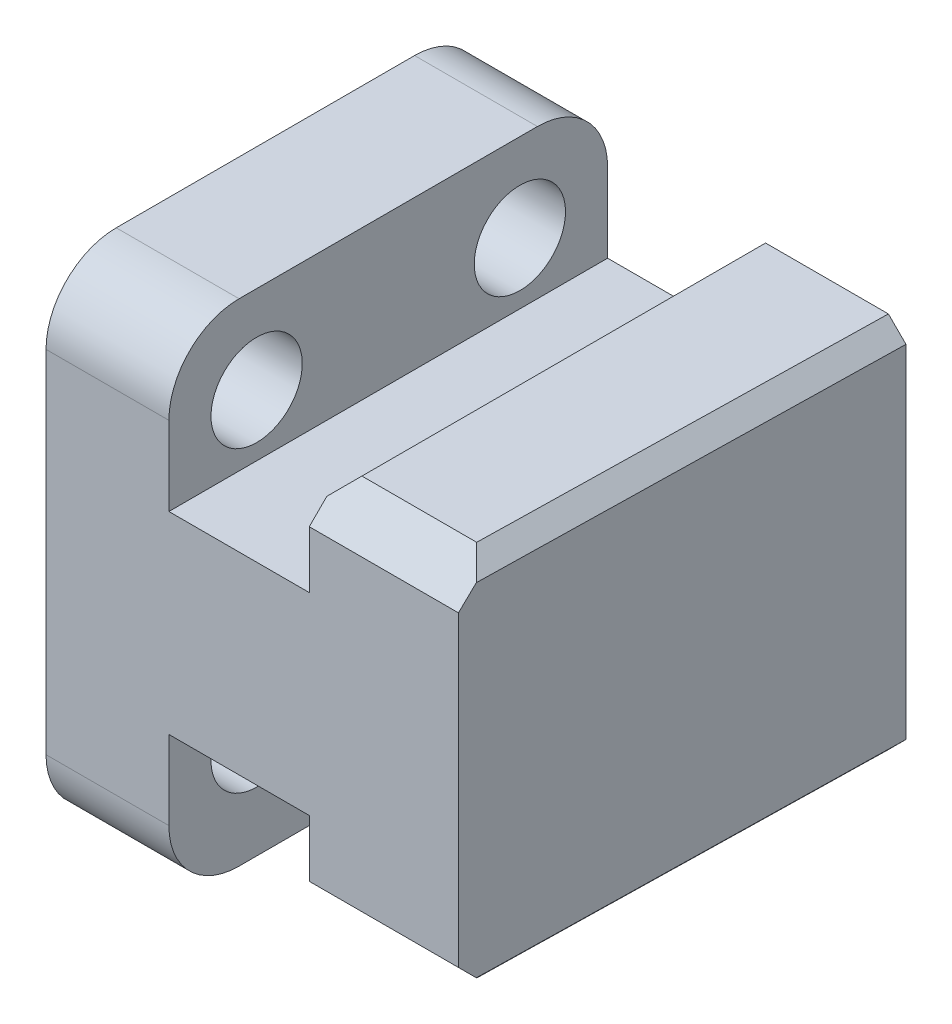
ISO-10303-21;
HEADER;
FILE_DESCRIPTION(('STEP AP214'),'2;1');
FILE_NAME('part.step','',(''),(''),'','','');
FILE_SCHEMA(('AUTOMOTIVE_DESIGN { 1 0 10303 214 1 1 1 1 }'));
ENDSEC;
DATA;
#1=APPLICATION_CONTEXT('core data for automotive mechanical design processes');
#2=APPLICATION_PROTOCOL_DEFINITION('international standard','automotive_design',2000,#1);
#3=PRODUCT_CONTEXT('',#1,'mechanical');
#4=PRODUCT('Part','Part','',(#3));
#5=PRODUCT_RELATED_PRODUCT_CATEGORY('part','',(#4));
#6=PRODUCT_DEFINITION_FORMATION('','',#4);
#7=PRODUCT_DEFINITION_CONTEXT('part definition',#1,'design');
#8=PRODUCT_DEFINITION('design','',#6,#7);
#9=PRODUCT_DEFINITION_SHAPE('','',#8);
#10=(LENGTH_UNIT() NAMED_UNIT(*) SI_UNIT(.MILLI.,.METRE.));
#11=(NAMED_UNIT(*) PLANE_ANGLE_UNIT() SI_UNIT($,.RADIAN.));
#12=(NAMED_UNIT(*) SI_UNIT($,.STERADIAN.) SOLID_ANGLE_UNIT());
#13=UNCERTAINTY_MEASURE_WITH_UNIT(LENGTH_MEASURE(1.E-05),#10,'distance_accuracy_value','');
#14=(GEOMETRIC_REPRESENTATION_CONTEXT(3) GLOBAL_UNCERTAINTY_ASSIGNED_CONTEXT((#13)) GLOBAL_UNIT_ASSIGNED_CONTEXT((#10,
#11,#12)) REPRESENTATION_CONTEXT('',''));
#15=CARTESIAN_POINT('',(0.,0.,0.));
#16=DIRECTION('',(0.,0.,1.));
#17=DIRECTION('',(1.,0.,0.));
#18=AXIS2_PLACEMENT_3D('',#15,#16,#17);
#19=CARTESIAN_POINT('',(7.,14.,25.));
#20=DIRECTION('',(0.,-1.,0.));
#21=DIRECTION('',(0.,0.,-1.));
#22=AXIS2_PLACEMENT_3D('',#19,#20,#21);
#23=PLANE('',#22);
#24=DIRECTION('',(0.,0.,-1.));
#25=VECTOR('',#24,1.);
#26=CARTESIAN_POINT('',(7.,14.,25.));
#27=LINE('',#26,#25);
#28=CARTESIAN_POINT('',(7.,14.,21.));
#29=VERTEX_POINT('',#28);
#30=CARTESIAN_POINT('',(7.,14.,4.));
#31=VERTEX_POINT('',#30);
#32=EDGE_CURVE('E352',#29,#31,#27,.T.);
#33=ORIENTED_EDGE('',*,*,#32,.T.);
#34=DIRECTION('',(-1.,0.,0.));
#35=VECTOR('',#34,1.);
#36=CARTESIAN_POINT('',(7.,14.,4.));
#37=LINE('',#36,#35);
#38=CARTESIAN_POINT('',(0.,14.,4.));
#39=VERTEX_POINT('',#38);
#40=EDGE_CURVE('E234',#31,#39,#37,.T.);
#41=ORIENTED_EDGE('',*,*,#40,.T.);
#42=DIRECTION('',(0.,0.,-1.));
#43=VECTOR('',#42,1.);
#44=CARTESIAN_POINT('',(0.,14.,25.));
#45=LINE('',#44,#43);
#46=CARTESIAN_POINT('',(0.,14.,21.));
#47=VERTEX_POINT('',#46);
#48=EDGE_CURVE('E397',#47,#39,#45,.T.);
#49=ORIENTED_EDGE('',*,*,#48,.F.);
#50=DIRECTION('',(-1.,0.,0.));
#51=VECTOR('',#50,1.);
#52=CARTESIAN_POINT('',(7.,14.,21.));
#53=LINE('',#52,#51);
#54=EDGE_CURVE('E229',#47,#29,#53,.F.);
#55=ORIENTED_EDGE('',*,*,#54,.T.);
#56=EDGE_LOOP('',(#33,#41,#49,#55));
#57=FACE_BOUND('',#56,.T.);
#58=ADVANCED_FACE('F33',(#57),#23,.F.);
#59=CARTESIAN_POINT('',(0.,14.,25.));
#60=DIRECTION('',(1.,0.,0.));
#61=DIRECTION('',(0.,1.,0.));
#62=AXIS2_PLACEMENT_3D('',#59,#60,#61);
#63=PLANE('',#62);
#64=CARTESIAN_POINT('',(0.,-8.,20.));
#65=DIRECTION('',(-1.,0.,0.));
#66=DIRECTION('',(0.,-1.,0.));
#67=AXIS2_PLACEMENT_3D('',#64,#65,#66);
#68=CIRCLE('',#67,2.6);
#69=CARTESIAN_POINT('',(0.,-10.6,20.));
#70=VERTEX_POINT('',#69);
#71=EDGE_CURVE('E221',#70,#70,#68,.T.);
#72=ORIENTED_EDGE('',*,*,#71,.F.);
#73=EDGE_LOOP('',(#72));
#74=FACE_BOUND('',#73,.T.);
#75=CARTESIAN_POINT('',(0.,-8.,5.));
#76=DIRECTION('',(-1.,0.,0.));
#77=DIRECTION('',(0.,-1.,0.));
#78=AXIS2_PLACEMENT_3D('',#75,#76,#77);
#79=CIRCLE('',#78,2.6);
#80=CARTESIAN_POINT('',(0.,-10.6,5.));
#81=VERTEX_POINT('',#80);
#82=EDGE_CURVE('E429',#81,#81,#79,.T.);
#83=ORIENTED_EDGE('',*,*,#82,.F.);
#84=EDGE_LOOP('',(#83));
#85=FACE_BOUND('',#84,.T.);
#86=CARTESIAN_POINT('',(0.,9.,20.));
#87=DIRECTION('',(-1.,0.,0.));
#88=DIRECTION('',(0.,-1.,0.));
#89=AXIS2_PLACEMENT_3D('',#86,#87,#88);
#90=CIRCLE('',#89,2.6);
#91=CARTESIAN_POINT('',(0.,6.4,20.));
#92=VERTEX_POINT('',#91);
#93=EDGE_CURVE('E407',#92,#92,#90,.T.);
#94=ORIENTED_EDGE('',*,*,#93,.F.);
#95=EDGE_LOOP('',(#94));
#96=FACE_BOUND('',#95,.T.);
#97=CARTESIAN_POINT('',(0.,9.,5.));
#98=DIRECTION('',(-1.,0.,0.));
#99=DIRECTION('',(0.,-1.,0.));
#100=AXIS2_PLACEMENT_3D('',#97,#98,#99);
#101=CIRCLE('',#100,2.6);
#102=CARTESIAN_POINT('',(0.,6.4,5.));
#103=VERTEX_POINT('',#102);
#104=EDGE_CURVE('E403',#103,#103,#101,.T.);
#105=ORIENTED_EDGE('',*,*,#104,.F.);
#106=EDGE_LOOP('',(#105));
#107=FACE_BOUND('',#106,.T.);
#108=ORIENTED_EDGE('',*,*,#48,.T.);
#109=CARTESIAN_POINT('',(0.,10.,4.));
#110=DIRECTION('',(1.,0.,0.));
#111=DIRECTION('',(0.,1.,0.));
#112=AXIS2_PLACEMENT_3D('',#109,#110,#111);
#113=CIRCLE('',#112,4.);
#114=CARTESIAN_POINT('',(0.,10.,0.));
#115=VERTEX_POINT('',#114);
#116=EDGE_CURVE('E243',#39,#115,#113,.F.);
#117=ORIENTED_EDGE('',*,*,#116,.T.);
#118=DIRECTION('',(0.,-1.,0.));
#119=VECTOR('',#118,1.);
#120=CARTESIAN_POINT('',(0.,14.,0.));
#121=LINE('',#120,#119);
#122=CARTESIAN_POINT('',(0.,-10.,0.));
#123=VERTEX_POINT('',#122);
#124=EDGE_CURVE('E353',#115,#123,#121,.T.);
#125=ORIENTED_EDGE('',*,*,#124,.T.);
#126=CARTESIAN_POINT('',(0.,-10.,4.));
#127=DIRECTION('',(1.,0.,0.));
#128=DIRECTION('',(0.,1.,0.));
#129=AXIS2_PLACEMENT_3D('',#126,#127,#128);
#130=CIRCLE('',#129,4.);
#131=CARTESIAN_POINT('',(0.,-14.,4.));
#132=VERTEX_POINT('',#131);
#133=EDGE_CURVE('E241',#123,#132,#130,.F.);
#134=ORIENTED_EDGE('',*,*,#133,.T.);
#135=DIRECTION('',(0.,0.,-1.));
#136=VECTOR('',#135,1.);
#137=CARTESIAN_POINT('',(0.,-14.,25.));
#138=LINE('',#137,#136);
#139=CARTESIAN_POINT('',(0.,-14.,21.));
#140=VERTEX_POINT('',#139);
#141=EDGE_CURVE('E394',#140,#132,#138,.T.);
#142=ORIENTED_EDGE('',*,*,#141,.F.);
#143=CARTESIAN_POINT('',(0.,-10.,21.));
#144=DIRECTION('',(1.,0.,0.));
#145=DIRECTION('',(0.,1.,0.));
#146=AXIS2_PLACEMENT_3D('',#143,#144,#145);
#147=CIRCLE('',#146,4.);
#148=CARTESIAN_POINT('',(0.,-10.,25.));
#149=VERTEX_POINT('',#148);
#150=EDGE_CURVE('E239',#140,#149,#147,.F.);
#151=ORIENTED_EDGE('',*,*,#150,.T.);
#152=DIRECTION('',(0.,-1.,0.));
#153=VECTOR('',#152,1.);
#154=CARTESIAN_POINT('',(0.,14.,25.));
#155=LINE('',#154,#153);
#156=CARTESIAN_POINT('',(0.,10.,25.));
#157=VERTEX_POINT('',#156);
#158=EDGE_CURVE('E378',#157,#149,#155,.T.);
#159=ORIENTED_EDGE('',*,*,#158,.F.);
#160=CARTESIAN_POINT('',(0.,10.,21.));
#161=DIRECTION('',(1.,0.,0.));
#162=DIRECTION('',(0.,1.,0.));
#163=AXIS2_PLACEMENT_3D('',#160,#161,#162);
#164=CIRCLE('',#163,4.);
#165=EDGE_CURVE('E237',#157,#47,#164,.F.);
#166=ORIENTED_EDGE('',*,*,#165,.T.);
#167=EDGE_LOOP('',(#108,#117,#125,#134,#142,#151,#159,#166));
#168=FACE_BOUND('',#167,.T.);
#169=ADVANCED_FACE('F475',(#74,#85,#96,#107,#168),#63,.F.);
#170=CARTESIAN_POINT('',(0.,-14.,25.));
#171=DIRECTION('',(0.,1.,0.));
#172=DIRECTION('',(0.,0.,1.));
#173=AXIS2_PLACEMENT_3D('',#170,#171,#172);
#174=PLANE('',#173);
#175=ORIENTED_EDGE('',*,*,#141,.T.);
#176=DIRECTION('',(1.,0.,0.));
#177=VECTOR('',#176,1.);
#178=CARTESIAN_POINT('',(0.,-14.,4.));
#179=LINE('',#178,#177);
#180=CARTESIAN_POINT('',(7.,-14.,4.));
#181=VERTEX_POINT('',#180);
#182=EDGE_CURVE('E255',#132,#181,#179,.T.);
#183=ORIENTED_EDGE('',*,*,#182,.T.);
#184=DIRECTION('',(0.,0.,-1.));
#185=VECTOR('',#184,1.);
#186=CARTESIAN_POINT('',(7.,-14.,25.));
#187=LINE('',#186,#185);
#188=CARTESIAN_POINT('',(7.,-14.,21.));
#189=VERTEX_POINT('',#188);
#190=EDGE_CURVE('E390',#189,#181,#187,.T.);
#191=ORIENTED_EDGE('',*,*,#190,.F.);
#192=DIRECTION('',(1.,0.,0.));
#193=VECTOR('',#192,1.);
#194=CARTESIAN_POINT('',(0.,-14.,21.));
#195=LINE('',#194,#193);
#196=EDGE_CURVE('E253',#189,#140,#195,.F.);
#197=ORIENTED_EDGE('',*,*,#196,.T.);
#198=EDGE_LOOP('',(#175,#183,#191,#197));
#199=FACE_BOUND('',#198,.T.);
#200=ADVANCED_FACE('F478',(#199),#174,.F.);
#201=CARTESIAN_POINT('',(7.,-14.,25.));
#202=DIRECTION('',(-1.,0.,0.));
#203=DIRECTION('',(0.,-1.,0.));
#204=AXIS2_PLACEMENT_3D('',#201,#202,#203);
#205=PLANE('',#204);
#206=ORIENTED_EDGE('',*,*,#190,.T.);
#207=CARTESIAN_POINT('',(7.00000000000001,-10.,4.));
#208=DIRECTION('',(-1.,0.,0.));
#209=DIRECTION('',(0.,-1.,0.));
#210=AXIS2_PLACEMENT_3D('',#207,#208,#209);
#211=CIRCLE('',#210,4.);
#212=CARTESIAN_POINT('',(7.00000000000001,-10.,0.));
#213=VERTEX_POINT('',#212);
#214=EDGE_CURVE('E260',#181,#213,#211,.F.);
#215=ORIENTED_EDGE('',*,*,#214,.T.);
#216=DIRECTION('',(0.,1.,0.));
#217=VECTOR('',#216,1.);
#218=CARTESIAN_POINT('',(7.,-14.,0.));
#219=LINE('',#218,#217);
#220=CARTESIAN_POINT('',(7.00000000000002,-5.5,0.));
#221=VERTEX_POINT('',#220);
#222=EDGE_CURVE('E356',#213,#221,#219,.T.);
#223=ORIENTED_EDGE('',*,*,#222,.T.);
#224=DIRECTION('',(0.,0.,-1.));
#225=VECTOR('',#224,1.);
#226=CARTESIAN_POINT('',(7.00000000000002,-5.5,25.));
#227=LINE('',#226,#225);
#228=CARTESIAN_POINT('',(7.00000000000002,-5.5,4.28585715714573));
#229=VERTEX_POINT('',#228);
#230=EDGE_CURVE('E388',#229,#221,#227,.T.);
#231=ORIENTED_EDGE('',*,*,#230,.F.);
#232=CARTESIAN_POINT('',(7.00000000000002,-8.,5.));
#233=DIRECTION('',(-1.,0.,0.));
#234=DIRECTION('',(0.,-1.,0.));
#235=AXIS2_PLACEMENT_3D('',#232,#233,#234);
#236=CIRCLE('',#235,2.6);
#237=CARTESIAN_POINT('',(7.00000000000002,-5.5,5.71414284285427));
#238=VERTEX_POINT('',#237);
#239=EDGE_CURVE('E423',#229,#238,#236,.T.);
#240=ORIENTED_EDGE('',*,*,#239,.T.);
#241=CARTESIAN_POINT('',(7.00000000000002,-5.5,19.2858571571457));
#242=VERTEX_POINT('',#241);
#243=EDGE_CURVE('E391',#242,#238,#227,.T.);
#244=ORIENTED_EDGE('',*,*,#243,.F.);
#245=CARTESIAN_POINT('',(7.00000000000002,-8.,20.));
#246=DIRECTION('',(-1.,0.,0.));
#247=DIRECTION('',(0.,-1.,0.));
#248=AXIS2_PLACEMENT_3D('',#245,#246,#247);
#249=CIRCLE('',#248,2.6);
#250=CARTESIAN_POINT('',(7.00000000000002,-5.5,20.7141428428543));
#251=VERTEX_POINT('',#250);
#252=EDGE_CURVE('E220',#242,#251,#249,.T.);
#253=ORIENTED_EDGE('',*,*,#252,.T.);
#254=CARTESIAN_POINT('',(7.00000000000002,-5.5,25.));
#255=VERTEX_POINT('',#254);
#256=EDGE_CURVE('E227',#255,#251,#227,.T.);
#257=ORIENTED_EDGE('',*,*,#256,.F.);
#258=DIRECTION('',(0.,1.,0.));
#259=VECTOR('',#258,1.);
#260=CARTESIAN_POINT('',(7.,-14.,25.));
#261=LINE('',#260,#259);
#262=CARTESIAN_POINT('',(7.00000000000001,-10.,25.));
#263=VERTEX_POINT('',#262);
#264=EDGE_CURVE('E443',#263,#255,#261,.T.);
#265=ORIENTED_EDGE('',*,*,#264,.F.);
#266=CARTESIAN_POINT('',(7.00000000000001,-10.,21.));
#267=DIRECTION('',(-1.,0.,0.));
#268=DIRECTION('',(0.,-1.,0.));
#269=AXIS2_PLACEMENT_3D('',#266,#267,#268);
#270=CIRCLE('',#269,4.);
#271=EDGE_CURVE('E258',#263,#189,#270,.F.);
#272=ORIENTED_EDGE('',*,*,#271,.T.);
#273=EDGE_LOOP('',(#206,#215,#223,#231,#240,#244,#253,#257,#265,#272));
#274=FACE_BOUND('',#273,.T.);
#275=ADVANCED_FACE('F421',(#274),#205,.F.);
#276=CARTESIAN_POINT('',(7.00000000000002,-5.5,25.));
#277=DIRECTION('',(0.,1.,0.));
#278=DIRECTION('',(-1.,0.,0.));
#279=AXIS2_PLACEMENT_3D('',#276,#277,#278);
#280=PLANE('',#279);
#281=DIRECTION('',(0.,0.,1.));
#282=VECTOR('',#281,1.);
#283=CARTESIAN_POINT('',(8.,-5.5,25.));
#284=LINE('',#283,#282);
#285=CARTESIAN_POINT('',(8.,-5.5,19.2858571571457));
#286=VERTEX_POINT('',#285);
#287=CARTESIAN_POINT('',(8.,-5.5,20.7141428428543));
#288=VERTEX_POINT('',#287);
#289=EDGE_CURVE('E205',#286,#288,#284,.T.);
#290=ORIENTED_EDGE('',*,*,#289,.F.);
#291=DIRECTION('',(-1.,0.,0.));
#292=VECTOR('',#291,1.);
#293=CARTESIAN_POINT('',(8.,-5.5,19.2858571571457));
#294=LINE('',#293,#292);
#295=EDGE_CURVE('E219',#286,#242,#294,.T.);
#296=ORIENTED_EDGE('',*,*,#295,.T.);
#297=ORIENTED_EDGE('',*,*,#243,.T.);
#298=DIRECTION('',(-1.,0.,0.));
#299=VECTOR('',#298,1.);
#300=CARTESIAN_POINT('',(8.,-5.5,5.71414284285427));
#301=LINE('',#300,#299);
#302=CARTESIAN_POINT('',(8.,-5.5,5.71414284285427));
#303=VERTEX_POINT('',#302);
#304=EDGE_CURVE('E409',#238,#303,#301,.F.);
#305=ORIENTED_EDGE('',*,*,#304,.T.);
#306=DIRECTION('',(0.,0.,1.));
#307=VECTOR('',#306,1.);
#308=CARTESIAN_POINT('',(8.,-5.5,25.));
#309=LINE('',#308,#307);
#310=CARTESIAN_POINT('',(8.,-5.5,4.28585715714573));
#311=VERTEX_POINT('',#310);
#312=EDGE_CURVE('E400',#311,#303,#309,.T.);
#313=ORIENTED_EDGE('',*,*,#312,.F.);
#314=DIRECTION('',(-1.,0.,0.));
#315=VECTOR('',#314,1.);
#316=CARTESIAN_POINT('',(8.,-5.5,4.28585715714573));
#317=LINE('',#316,#315);
#318=EDGE_CURVE('E214',#311,#229,#317,.T.);
#319=ORIENTED_EDGE('',*,*,#318,.T.);
#320=ORIENTED_EDGE('',*,*,#230,.T.);
#321=DIRECTION('',(1.,0.,0.));
#322=VECTOR('',#321,1.);
#323=CARTESIAN_POINT('',(7.00000000000002,-5.5,0.));
#324=LINE('',#323,#322);
#325=CARTESIAN_POINT('',(15.,-5.5,0.));
#326=VERTEX_POINT('',#325);
#327=EDGE_CURVE('E359',#221,#326,#324,.T.);
#328=ORIENTED_EDGE('',*,*,#327,.T.);
#329=DIRECTION('',(0.,0.,-1.));
#330=VECTOR('',#329,1.);
#331=CARTESIAN_POINT('',(15.,-5.5,25.));
#332=LINE('',#331,#330);
#333=CARTESIAN_POINT('',(15.,-5.5,25.));
#334=VERTEX_POINT('',#333);
#335=EDGE_CURVE('E385',#334,#326,#332,.T.);
#336=ORIENTED_EDGE('',*,*,#335,.F.);
#337=DIRECTION('',(1.,0.,0.));
#338=VECTOR('',#337,1.);
#339=CARTESIAN_POINT('',(7.00000000000002,-5.5,25.));
#340=LINE('',#339,#338);
#341=EDGE_CURVE('E346',#255,#334,#340,.T.);
#342=ORIENTED_EDGE('',*,*,#341,.F.);
#343=ORIENTED_EDGE('',*,*,#256,.T.);
#344=DIRECTION('',(-1.,0.,0.));
#345=VECTOR('',#344,1.);
#346=CARTESIAN_POINT('',(8.,-5.5,20.7141428428543));
#347=LINE('',#346,#345);
#348=EDGE_CURVE('E213',#251,#288,#347,.F.);
#349=ORIENTED_EDGE('',*,*,#348,.T.);
#350=EDGE_LOOP('',(#290,#296,#297,#305,#313,#319,#320,#328,#336,#342,#343,#349));
#351=FACE_BOUND('',#350,.T.);
#352=ADVANCED_FACE('F224',(#351),#280,.F.);
#353=CARTESIAN_POINT('',(15.,-5.5,25.));
#354=DIRECTION('',(1.,0.,0.));
#355=DIRECTION('',(0.,1.,0.));
#356=AXIS2_PLACEMENT_3D('',#353,#354,#355);
#357=PLANE('',#356);
#358=DIRECTION('',(0.,-1.,0.));
#359=VECTOR('',#358,1.);
#360=CARTESIAN_POINT('',(15.,-5.5,0.));
#361=LINE('',#360,#359);
#362=CARTESIAN_POINT('',(15.,-9.75,0.));
#363=VERTEX_POINT('',#362);
#364=EDGE_CURVE('E361',#326,#363,#361,.T.);
#365=ORIENTED_EDGE('',*,*,#364,.T.);
#366=DIRECTION('',(0.,0.,1.));
#367=VECTOR('',#366,1.);
#368=CARTESIAN_POINT('',(15.,-9.75,25.));
#369=LINE('',#368,#367);
#370=CARTESIAN_POINT('',(15.,-9.75,24.));
#371=VERTEX_POINT('',#370);
#372=EDGE_CURVE('E303',#363,#371,#369,.T.);
#373=ORIENTED_EDGE('',*,*,#372,.T.);
#374=DIRECTION('',(0.,0.707106781186546,0.707106781186549));
#375=VECTOR('',#374,1.);
#376=CARTESIAN_POINT('',(15.,-8.75000000000001,25.));
#377=LINE('',#376,#375);
#378=CARTESIAN_POINT('',(15.,-8.75,25.));
#379=VERTEX_POINT('',#378);
#380=EDGE_CURVE('E282',#371,#379,#377,.T.);
#381=ORIENTED_EDGE('',*,*,#380,.T.);
#382=DIRECTION('',(0.,-1.,0.));
#383=VECTOR('',#382,1.);
#384=CARTESIAN_POINT('',(15.,-5.5,25.));
#385=LINE('',#384,#383);
#386=EDGE_CURVE('E342',#334,#379,#385,.T.);
#387=ORIENTED_EDGE('',*,*,#386,.F.);
#388=ORIENTED_EDGE('',*,*,#335,.T.);
#389=EDGE_LOOP('',(#365,#373,#381,#387,#388));
#390=FACE_BOUND('',#389,.T.);
#391=ADVANCED_FACE('F450',(#390),#357,.F.);
#392=CARTESIAN_POINT('',(15.,-10.75,25.));
#393=DIRECTION('',(0.,1.,0.));
#394=DIRECTION('',(0.,0.,1.));
#395=AXIS2_PLACEMENT_3D('',#392,#393,#394);
#396=PLANE('',#395);
#397=DIRECTION('',(-1.,0.,0.));
#398=VECTOR('',#397,1.);
#399=CARTESIAN_POINT('',(15.,-10.75,23.));
#400=LINE('',#399,#398);
#401=CARTESIAN_POINT('',(22.539800019996,-10.75,23.));
#402=VERTEX_POINT('',#401);
#403=CARTESIAN_POINT('',(16.,-10.75,23.));
#404=VERTEX_POINT('',#403);
#405=EDGE_CURVE('E279',#402,#404,#400,.T.);
#406=ORIENTED_EDGE('',*,*,#405,.T.);
#407=DIRECTION('',(0.,0.,-1.));
#408=VECTOR('',#407,1.);
#409=CARTESIAN_POINT('',(16.,-10.75,25.));
#410=LINE('',#409,#408);
#411=CARTESIAN_POINT('',(16.,-10.75,0.));
#412=VERTEX_POINT('',#411);
#413=EDGE_CURVE('E292',#404,#412,#410,.T.);
#414=ORIENTED_EDGE('',*,*,#413,.T.);
#415=DIRECTION('',(1.,0.,0.));
#416=VECTOR('',#415,1.);
#417=CARTESIAN_POINT('',(15.,-10.75,0.));
#418=LINE('',#417,#416);
#419=CARTESIAN_POINT('',(22.999800019996,-10.75,0.));
#420=VERTEX_POINT('',#419);
#421=EDGE_CURVE('E364',#412,#420,#418,.T.);
#422=ORIENTED_EDGE('',*,*,#421,.T.);
#423=DIRECTION('',(-0.0199960011996002,0.,0.999800059980007));
#424=VECTOR('',#423,1.);
#425=CARTESIAN_POINT('',(22.4968012994762,-10.75,25.1499360259895));
#426=LINE('',#425,#424);
#427=EDGE_CURVE('E289',#420,#402,#426,.T.);
#428=ORIENTED_EDGE('',*,*,#427,.T.);
#429=EDGE_LOOP('',(#406,#414,#422,#428));
#430=FACE_BOUND('',#429,.T.);
#431=ADVANCED_FACE('F462',(#430),#396,.F.);
#432=CARTESIAN_POINT('',(24.,10.75,25.));
#433=DIRECTION('',(0.,-1.,0.));
#434=DIRECTION('',(0.,0.,-1.));
#435=AXIS2_PLACEMENT_3D('',#432,#433,#434);
#436=PLANE('',#435);
#437=DIRECTION('',(-1.,0.,0.));
#438=VECTOR('',#437,1.);
#439=CARTESIAN_POINT('',(24.,10.75,0.));
#440=LINE('',#439,#438);
#441=CARTESIAN_POINT('',(22.999800019996,10.75,0.));
#442=VERTEX_POINT('',#441);
#443=CARTESIAN_POINT('',(16.,10.75,0.));
#444=VERTEX_POINT('',#443);
#445=EDGE_CURVE('E368',#442,#444,#440,.T.);
#446=ORIENTED_EDGE('',*,*,#445,.T.);
#447=DIRECTION('',(0.,0.,1.));
#448=VECTOR('',#447,1.);
#449=CARTESIAN_POINT('',(16.,10.75,25.));
#450=LINE('',#449,#448);
#451=CARTESIAN_POINT('',(16.,10.75,23.));
#452=VERTEX_POINT('',#451);
#453=EDGE_CURVE('E314',#444,#452,#450,.T.);
#454=ORIENTED_EDGE('',*,*,#453,.T.);
#455=DIRECTION('',(1.,0.,0.));
#456=VECTOR('',#455,1.);
#457=CARTESIAN_POINT('',(23.5,10.75,23.));
#458=LINE('',#457,#456);
#459=CARTESIAN_POINT('',(22.539800019996,10.75,23.));
#460=VERTEX_POINT('',#459);
#461=EDGE_CURVE('E287',#452,#460,#458,.T.);
#462=ORIENTED_EDGE('',*,*,#461,.T.);
#463=DIRECTION('',(0.0199960011996002,0.,-0.999800059980007));
#464=VECTOR('',#463,1.);
#465=CARTESIAN_POINT('',(22.500399860052,10.75,24.970007997201));
#466=LINE('',#465,#464);
#467=EDGE_CURVE('E312',#460,#442,#466,.T.);
#468=ORIENTED_EDGE('',*,*,#467,.T.);
#469=EDGE_LOOP('',(#446,#454,#462,#468));
#470=FACE_BOUND('',#469,.T.);
#471=ADVANCED_FACE('F538',(#470),#436,.F.);
#472=CARTESIAN_POINT('',(15.,10.75,25.));
#473=DIRECTION('',(1.,0.,0.));
#474=DIRECTION('',(0.,1.,0.));
#475=AXIS2_PLACEMENT_3D('',#472,#473,#474);
#476=PLANE('',#475);
#477=DIRECTION('',(0.,0.707106781186546,-0.707106781186549));
#478=VECTOR('',#477,1.);
#479=CARTESIAN_POINT('',(15.,8.75000000000001,25.));
#480=LINE('',#479,#478);
#481=CARTESIAN_POINT('',(15.,8.75,25.));
#482=VERTEX_POINT('',#481);
#483=CARTESIAN_POINT('',(15.,9.74999999999999,24.));
#484=VERTEX_POINT('',#483);
#485=EDGE_CURVE('E284',#482,#484,#480,.T.);
#486=ORIENTED_EDGE('',*,*,#485,.T.);
#487=DIRECTION('',(0.,0.,-1.));
#488=VECTOR('',#487,1.);
#489=CARTESIAN_POINT('',(15.,9.74999999999999,25.));
#490=LINE('',#489,#488);
#491=CARTESIAN_POINT('',(15.,9.74999999999999,0.));
#492=VERTEX_POINT('',#491);
#493=EDGE_CURVE('E309',#484,#492,#490,.T.);
#494=ORIENTED_EDGE('',*,*,#493,.T.);
#495=DIRECTION('',(0.,-1.,0.));
#496=VECTOR('',#495,1.);
#497=CARTESIAN_POINT('',(15.,10.75,0.));
#498=LINE('',#497,#496);
#499=CARTESIAN_POINT('',(15.,5.5,0.));
#500=VERTEX_POINT('',#499);
#501=EDGE_CURVE('E371',#492,#500,#498,.T.);
#502=ORIENTED_EDGE('',*,*,#501,.T.);
#503=DIRECTION('',(0.,0.,-1.));
#504=VECTOR('',#503,1.);
#505=CARTESIAN_POINT('',(15.,5.5,25.));
#506=LINE('',#505,#504);
#507=CARTESIAN_POINT('',(15.,5.5,25.));
#508=VERTEX_POINT('',#507);
#509=EDGE_CURVE('E339',#508,#500,#506,.T.);
#510=ORIENTED_EDGE('',*,*,#509,.F.);
#511=DIRECTION('',(0.,-1.,0.));
#512=VECTOR('',#511,1.);
#513=CARTESIAN_POINT('',(15.,10.75,25.));
#514=LINE('',#513,#512);
#515=EDGE_CURVE('E332',#482,#508,#514,.T.);
#516=ORIENTED_EDGE('',*,*,#515,.F.);
#517=EDGE_LOOP('',(#486,#494,#502,#510,#516));
#518=FACE_BOUND('',#517,.T.);
#519=ADVANCED_FACE('F336',(#518),#476,.F.);
#520=CARTESIAN_POINT('',(15.,5.5,25.));
#521=DIRECTION('',(0.,-1.,0.));
#522=DIRECTION('',(1.,0.,0.));
#523=AXIS2_PLACEMENT_3D('',#520,#521,#522);
#524=PLANE('',#523);
#525=DIRECTION('',(-1.,0.,0.));
#526=VECTOR('',#525,1.);
#527=CARTESIAN_POINT('',(15.,5.5,0.));
#528=LINE('',#527,#526);
#529=CARTESIAN_POINT('',(7.00000000000002,5.5,0.));
#530=VERTEX_POINT('',#529);
#531=EDGE_CURVE('E373',#500,#530,#528,.T.);
#532=ORIENTED_EDGE('',*,*,#531,.T.);
#533=DIRECTION('',(0.,0.,-1.));
#534=VECTOR('',#533,1.);
#535=CARTESIAN_POINT('',(7.00000000000002,5.5,25.));
#536=LINE('',#535,#534);
#537=CARTESIAN_POINT('',(7.00000000000002,5.5,25.));
#538=VERTEX_POINT('',#537);
#539=EDGE_CURVE('E381',#538,#530,#536,.T.);
#540=ORIENTED_EDGE('',*,*,#539,.F.);
#541=DIRECTION('',(-1.,0.,0.));
#542=VECTOR('',#541,1.);
#543=CARTESIAN_POINT('',(15.,5.5,25.));
#544=LINE('',#543,#542);
#545=EDGE_CURVE('E341',#508,#538,#544,.T.);
#546=ORIENTED_EDGE('',*,*,#545,.F.);
#547=ORIENTED_EDGE('',*,*,#509,.T.);
#548=EDGE_LOOP('',(#532,#540,#546,#547));
#549=FACE_BOUND('',#548,.T.);
#550=ADVANCED_FACE('F502',(#549),#524,.F.);
#551=CARTESIAN_POINT('',(7.00000000000002,5.5,25.));
#552=DIRECTION('',(-1.,0.,0.));
#553=DIRECTION('',(0.,-1.,0.));
#554=AXIS2_PLACEMENT_3D('',#551,#552,#553);
#555=PLANE('',#554);
#556=CARTESIAN_POINT('',(7.00000000000001,9.,20.));
#557=DIRECTION('',(-1.,0.,0.));
#558=DIRECTION('',(0.,-1.,0.));
#559=AXIS2_PLACEMENT_3D('',#556,#557,#558);
#560=CIRCLE('',#559,2.6);
#561=CARTESIAN_POINT('',(7.00000000000002,6.4,20.));
#562=VERTEX_POINT('',#561);
#563=EDGE_CURVE('E404',#562,#562,#560,.T.);
#564=ORIENTED_EDGE('',*,*,#563,.T.);
#565=EDGE_LOOP('',(#564));
#566=FACE_BOUND('',#565,.T.);
#567=CARTESIAN_POINT('',(7.00000000000001,9.,5.));
#568=DIRECTION('',(-1.,0.,0.));
#569=DIRECTION('',(0.,-1.,0.));
#570=AXIS2_PLACEMENT_3D('',#567,#568,#569);
#571=CIRCLE('',#570,2.6);
#572=CARTESIAN_POINT('',(7.00000000000002,6.4,5.));
#573=VERTEX_POINT('',#572);
#574=EDGE_CURVE('E357',#573,#573,#571,.T.);
#575=ORIENTED_EDGE('',*,*,#574,.T.);
#576=EDGE_LOOP('',(#575));
#577=FACE_BOUND('',#576,.T.);
#578=DIRECTION('',(0.,1.,0.));
#579=VECTOR('',#578,1.);
#580=CARTESIAN_POINT('',(7.00000000000002,5.5,0.));
#581=LINE('',#580,#579);
#582=CARTESIAN_POINT('',(7.00000000000001,10.,0.));
#583=VERTEX_POINT('',#582);
#584=EDGE_CURVE('E375',#530,#583,#581,.T.);
#585=ORIENTED_EDGE('',*,*,#584,.T.);
#586=CARTESIAN_POINT('',(7.00000000000001,10.,4.));
#587=DIRECTION('',(-1.,0.,0.));
#588=DIRECTION('',(0.,-1.,0.));
#589=AXIS2_PLACEMENT_3D('',#586,#587,#588);
#590=CIRCLE('',#589,4.);
#591=EDGE_CURVE('E251',#583,#31,#590,.F.);
#592=ORIENTED_EDGE('',*,*,#591,.T.);
#593=ORIENTED_EDGE('',*,*,#32,.F.);
#594=CARTESIAN_POINT('',(7.00000000000001,10.,21.));
#595=DIRECTION('',(-1.,0.,0.));
#596=DIRECTION('',(0.,-1.,0.));
#597=AXIS2_PLACEMENT_3D('',#594,#595,#596);
#598=CIRCLE('',#597,4.);
#599=CARTESIAN_POINT('',(7.00000000000001,10.,25.));
#600=VERTEX_POINT('',#599);
#601=EDGE_CURVE('E249',#29,#600,#598,.F.);
#602=ORIENTED_EDGE('',*,*,#601,.T.);
#603=DIRECTION('',(0.,1.,0.));
#604=VECTOR('',#603,1.);
#605=CARTESIAN_POINT('',(7.00000000000002,5.5,25.));
#606=LINE('',#605,#604);
#607=EDGE_CURVE('E344',#538,#600,#606,.T.);
#608=ORIENTED_EDGE('',*,*,#607,.F.);
#609=ORIENTED_EDGE('',*,*,#539,.T.);
#610=EDGE_LOOP('',(#585,#592,#593,#602,#608,#609));
#611=FACE_BOUND('',#610,.T.);
#612=ADVANCED_FACE('F499',(#566,#577,#611),#555,.F.);
#613=CARTESIAN_POINT('',(0.,14.,25.));
#614=DIRECTION('',(0.,0.,1.));
#615=DIRECTION('',(1.,0.,0.));
#616=AXIS2_PLACEMENT_3D('',#613,#614,#615);
#617=PLANE('',#616);
#618=ORIENTED_EDGE('',*,*,#386,.T.);
#619=DIRECTION('',(1.,0.,0.));
#620=VECTOR('',#619,1.);
#621=CARTESIAN_POINT('',(23.5,-8.75000000000001,25.));
#622=LINE('',#621,#620);
#623=CARTESIAN_POINT('',(23.5,-8.75,25.));
#624=VERTEX_POINT('',#623);
#625=EDGE_CURVE('E271',#379,#624,#622,.T.);
#626=ORIENTED_EDGE('',*,*,#625,.T.);
#627=DIRECTION('',(0.,1.,0.));
#628=VECTOR('',#627,1.);
#629=CARTESIAN_POINT('',(23.5,-14.,25.));
#630=LINE('',#629,#628);
#631=CARTESIAN_POINT('',(23.5,8.74999999999999,25.));
#632=VERTEX_POINT('',#631);
#633=EDGE_CURVE('E334',#624,#632,#630,.T.);
#634=ORIENTED_EDGE('',*,*,#633,.T.);
#635=DIRECTION('',(-1.,0.,0.));
#636=VECTOR('',#635,1.);
#637=CARTESIAN_POINT('',(15.,8.75,25.));
#638=LINE('',#637,#636);
#639=EDGE_CURVE('E268',#632,#482,#638,.T.);
#640=ORIENTED_EDGE('',*,*,#639,.T.);
#641=ORIENTED_EDGE('',*,*,#515,.T.);
#642=ORIENTED_EDGE('',*,*,#545,.T.);
#643=ORIENTED_EDGE('',*,*,#607,.T.);
#644=DIRECTION('',(-1.,0.,0.));
#645=VECTOR('',#644,1.);
#646=CARTESIAN_POINT('',(0.,10.,25.));
#647=LINE('',#646,#645);
#648=EDGE_CURVE('E262',#600,#157,#647,.T.);
#649=ORIENTED_EDGE('',*,*,#648,.T.);
#650=ORIENTED_EDGE('',*,*,#158,.T.);
#651=DIRECTION('',(1.,0.,0.));
#652=VECTOR('',#651,1.);
#653=CARTESIAN_POINT('',(7.,-10.,25.));
#654=LINE('',#653,#652);
#655=EDGE_CURVE('E265',#149,#263,#654,.T.);
#656=ORIENTED_EDGE('',*,*,#655,.T.);
#657=ORIENTED_EDGE('',*,*,#264,.T.);
#658=ORIENTED_EDGE('',*,*,#341,.T.);
#659=EDGE_LOOP('',(#618,#626,#634,#640,#641,#642,#643,#649,#650,#656,#657,#658));
#660=FACE_BOUND('',#659,.T.);
#661=ADVANCED_FACE('F331',(#660),#617,.T.);
#662=CARTESIAN_POINT('',(0.,14.,0.));
#663=DIRECTION('',(0.,0.,1.));
#664=DIRECTION('',(1.,0.,0.));
#665=AXIS2_PLACEMENT_3D('',#662,#663,#664);
#666=PLANE('',#665);
#667=ORIENTED_EDGE('',*,*,#421,.F.);
#668=DIRECTION('',(0.707106781186546,-0.707106781186549,0.));
#669=VECTOR('',#668,1.);
#670=CARTESIAN_POINT('',(16.,-10.75,0.));
#671=LINE('',#670,#669);
#672=EDGE_CURVE('E301',#412,#363,#671,.F.);
#673=ORIENTED_EDGE('',*,*,#672,.T.);
#674=ORIENTED_EDGE('',*,*,#364,.F.);
#675=ORIENTED_EDGE('',*,*,#327,.F.);
#676=ORIENTED_EDGE('',*,*,#222,.F.);
#677=DIRECTION('',(1.,0.,0.));
#678=VECTOR('',#677,1.);
#679=CARTESIAN_POINT('',(0.,-10.,0.));
#680=LINE('',#679,#678);
#681=EDGE_CURVE('E245',#213,#123,#680,.F.);
#682=ORIENTED_EDGE('',*,*,#681,.T.);
#683=ORIENTED_EDGE('',*,*,#124,.F.);
#684=DIRECTION('',(-1.,0.,0.));
#685=VECTOR('',#684,1.);
#686=CARTESIAN_POINT('',(0.,10.,0.));
#687=LINE('',#686,#685);
#688=EDGE_CURVE('E247',#115,#583,#687,.F.);
#689=ORIENTED_EDGE('',*,*,#688,.T.);
#690=ORIENTED_EDGE('',*,*,#584,.F.);
#691=ORIENTED_EDGE('',*,*,#531,.F.);
#692=ORIENTED_EDGE('',*,*,#501,.F.);
#693=DIRECTION('',(-0.707106781186548,-0.707106781186548,0.));
#694=VECTOR('',#693,1.);
#695=CARTESIAN_POINT('',(15.,9.74999999999999,0.));
#696=LINE('',#695,#694);
#697=EDGE_CURVE('E299',#492,#444,#696,.F.);
#698=ORIENTED_EDGE('',*,*,#697,.T.);
#699=ORIENTED_EDGE('',*,*,#445,.F.);
#700=DIRECTION('',(-0.707177474191594,0.70703608111326,0.));
#701=VECTOR('',#700,1.);
#702=CARTESIAN_POINT('',(24.,9.75000000000001,0.));
#703=LINE('',#702,#701);
#704=CARTESIAN_POINT('',(24.,9.75000000000001,0.));
#705=VERTEX_POINT('',#704);
#706=EDGE_CURVE('E295',#442,#705,#703,.F.);
#707=ORIENTED_EDGE('',*,*,#706,.T.);
#708=DIRECTION('',(0.,1.,0.));
#709=VECTOR('',#708,1.);
#710=CARTESIAN_POINT('',(24.,-10.75,0.));
#711=LINE('',#710,#709);
#712=CARTESIAN_POINT('',(24.,-9.75,0.));
#713=VERTEX_POINT('',#712);
#714=EDGE_CURVE('E324',#713,#705,#711,.T.);
#715=ORIENTED_EDGE('',*,*,#714,.F.);
#716=DIRECTION('',(0.70717747419159,0.707036081113265,0.));
#717=VECTOR('',#716,1.);
#718=CARTESIAN_POINT('',(22.748250369922,-11.0014993552319,0.));
#719=LINE('',#718,#717);
#720=EDGE_CURVE('E297',#713,#420,#719,.F.);
#721=ORIENTED_EDGE('',*,*,#720,.T.);
#722=EDGE_LOOP('',(#667,#673,#674,#675,#676,#682,#683,#689,#690,#691,#692,#698,#699,#707,#715,#721));
#723=FACE_BOUND('',#722,.T.);
#724=ADVANCED_FACE('F465',(#723),#666,.F.);
#725=CARTESIAN_POINT('',(8.,9.,5.));
#726=DIRECTION('',(-1.,0.,0.));
#727=DIRECTION('',(0.,-1.,0.));
#728=AXIS2_PLACEMENT_3D('',#725,#726,#727);
#729=CYLINDRICAL_SURFACE('',#728,2.6);
#730=ORIENTED_EDGE('',*,*,#104,.T.);
#731=EDGE_LOOP('',(#730));
#732=FACE_BOUND('',#731,.T.);
#733=ORIENTED_EDGE('',*,*,#574,.F.);
#734=EDGE_LOOP('',(#733));
#735=FACE_BOUND('',#734,.T.);
#736=ADVANCED_FACE('F551',(#732,#735),#729,.F.);
#737=CARTESIAN_POINT('',(8.,9.,20.));
#738=DIRECTION('',(-1.,0.,0.));
#739=DIRECTION('',(0.,-1.,0.));
#740=AXIS2_PLACEMENT_3D('',#737,#738,#739);
#741=CYLINDRICAL_SURFACE('',#740,2.6);
#742=ORIENTED_EDGE('',*,*,#93,.T.);
#743=EDGE_LOOP('',(#742));
#744=FACE_BOUND('',#743,.T.);
#745=ORIENTED_EDGE('',*,*,#563,.F.);
#746=EDGE_LOOP('',(#745));
#747=FACE_BOUND('',#746,.T.);
#748=ADVANCED_FACE('F556',(#744,#747),#741,.F.);
#749=CARTESIAN_POINT('',(8.,-8.,5.));
#750=DIRECTION('',(-1.,0.,0.));
#751=DIRECTION('',(0.,-1.,0.));
#752=AXIS2_PLACEMENT_3D('',#749,#750,#751);
#753=CYLINDRICAL_SURFACE('',#752,2.6);
#754=ORIENTED_EDGE('',*,*,#82,.T.);
#755=EDGE_LOOP('',(#754));
#756=FACE_BOUND('',#755,.T.);
#757=CARTESIAN_POINT('',(8.,-8.,5.));
#758=DIRECTION('',(-1.,0.,0.));
#759=DIRECTION('',(0.,-1.,0.));
#760=AXIS2_PLACEMENT_3D('',#757,#758,#759);
#761=CIRCLE('',#760,2.6);
#762=EDGE_CURVE('E427',#303,#311,#761,.T.);
#763=ORIENTED_EDGE('',*,*,#762,.F.);
#764=ORIENTED_EDGE('',*,*,#304,.F.);
#765=ORIENTED_EDGE('',*,*,#239,.F.);
#766=ORIENTED_EDGE('',*,*,#318,.F.);
#767=EDGE_LOOP('',(#763,#764,#765,#766));
#768=FACE_BOUND('',#767,.T.);
#769=ADVANCED_FACE('F426',(#756,#768),#753,.F.);
#770=CARTESIAN_POINT('',(8.,-8.,5.));
#771=DIRECTION('',(-1.,0.,0.));
#772=DIRECTION('',(0.,-1.,0.));
#773=AXIS2_PLACEMENT_3D('',#770,#771,#772);
#774=PLANE('',#773);
#775=ORIENTED_EDGE('',*,*,#312,.T.);
#776=ORIENTED_EDGE('',*,*,#762,.T.);
#777=EDGE_LOOP('',(#775,#776));
#778=FACE_BOUND('',#777,.T.);
#779=ADVANCED_FACE('F563',(#778),#774,.T.);
#780=CARTESIAN_POINT('',(8.,-8.,20.));
#781=DIRECTION('',(-1.,0.,0.));
#782=DIRECTION('',(0.,-1.,0.));
#783=AXIS2_PLACEMENT_3D('',#780,#781,#782);
#784=CYLINDRICAL_SURFACE('',#783,2.6);
#785=ORIENTED_EDGE('',*,*,#71,.T.);
#786=EDGE_LOOP('',(#785));
#787=FACE_BOUND('',#786,.T.);
#788=CARTESIAN_POINT('',(8.,-8.,20.));
#789=DIRECTION('',(-1.,0.,0.));
#790=DIRECTION('',(0.,-1.,0.));
#791=AXIS2_PLACEMENT_3D('',#788,#789,#790);
#792=CIRCLE('',#791,2.6);
#793=EDGE_CURVE('E208',#288,#286,#792,.T.);
#794=ORIENTED_EDGE('',*,*,#793,.F.);
#795=ORIENTED_EDGE('',*,*,#348,.F.);
#796=ORIENTED_EDGE('',*,*,#252,.F.);
#797=ORIENTED_EDGE('',*,*,#295,.F.);
#798=EDGE_LOOP('',(#794,#795,#796,#797));
#799=FACE_BOUND('',#798,.T.);
#800=ADVANCED_FACE('F217',(#787,#799),#784,.F.);
#801=CARTESIAN_POINT('',(8.,-8.,20.));
#802=DIRECTION('',(-1.,0.,0.));
#803=DIRECTION('',(0.,-1.,0.));
#804=AXIS2_PLACEMENT_3D('',#801,#802,#803);
#805=PLANE('',#804);
#806=ORIENTED_EDGE('',*,*,#289,.T.);
#807=ORIENTED_EDGE('',*,*,#793,.T.);
#808=EDGE_LOOP('',(#806,#807));
#809=FACE_BOUND('',#808,.T.);
#810=ADVANCED_FACE('F207',(#809),#805,.T.);
#811=CARTESIAN_POINT('',(24.,-14.,0.));
#812=DIRECTION('',(-0.999800059980007,0.,-0.0199960011996002));
#813=DIRECTION('',(-0.0199960011996002,0.,0.999800059980007));
#814=AXIS2_PLACEMENT_3D('',#811,#812,#813);
#815=PLANE('',#814);
#816=DIRECTION('',(0.0141407216222653,-0.707036081113262,-0.707036081113265));
#817=VECTOR('',#816,1.);
#818=CARTESIAN_POINT('',(23.4953009398121,-8.51504699060188,25.2349530093981));
#819=LINE('',#818,#817);
#820=CARTESIAN_POINT('',(23.52,-9.75,24.));
#821=VERTEX_POINT('',#820);
#822=EDGE_CURVE('E276',#624,#821,#819,.T.);
#823=ORIENTED_EDGE('',*,*,#822,.T.);
#824=DIRECTION('',(0.0199960011996002,0.,-0.999800059980007));
#825=VECTOR('',#824,1.);
#826=CARTESIAN_POINT('',(24.,-9.75,0.));
#827=LINE('',#826,#825);
#828=EDGE_CURVE('E11',#821,#713,#827,.T.);
#829=ORIENTED_EDGE('',*,*,#828,.T.);
#830=ORIENTED_EDGE('',*,*,#714,.T.);
#831=DIRECTION('',(-0.0199960011996002,0.,0.999800059980007));
#832=VECTOR('',#831,1.);
#833=CARTESIAN_POINT('',(24.,9.75000000000001,0.));
#834=LINE('',#833,#832);
#835=CARTESIAN_POINT('',(23.52,9.75000000000001,24.));
#836=VERTEX_POINT('',#835);
#837=EDGE_CURVE('E41',#705,#836,#834,.T.);
#838=ORIENTED_EDGE('',*,*,#837,.T.);
#839=DIRECTION('',(-0.0141407216222653,-0.707036081113262,0.707036081113265));
#840=VECTOR('',#839,1.);
#841=CARTESIAN_POINT('',(23.4953009398121,8.51504699060188,25.2349530093981));
#842=LINE('',#841,#840);
#843=EDGE_CURVE('E274',#836,#632,#842,.T.);
#844=ORIENTED_EDGE('',*,*,#843,.T.);
#845=ORIENTED_EDGE('',*,*,#633,.F.);
#846=EDGE_LOOP('',(#823,#829,#830,#838,#844,#845));
#847=FACE_BOUND('',#846,.T.);
#848=ADVANCED_FACE('F320',(#847),#815,.F.);
#849=CARTESIAN_POINT('',(7.,10.,4.));
#850=DIRECTION('',(-1.,0.,0.));
#851=DIRECTION('',(0.,0.,1.));
#852=AXIS2_PLACEMENT_3D('',#849,#850,#851);
#853=CYLINDRICAL_SURFACE('',#852,4.);
#854=ORIENTED_EDGE('',*,*,#591,.F.);
#855=ORIENTED_EDGE('',*,*,#688,.F.);
#856=ORIENTED_EDGE('',*,*,#116,.F.);
#857=ORIENTED_EDGE('',*,*,#40,.F.);
#858=EDGE_LOOP('',(#854,#855,#856,#857));
#859=FACE_BOUND('',#858,.T.);
#860=ADVANCED_FACE('F509',(#859),#853,.T.);
#861=CARTESIAN_POINT('',(0.,-10.,4.));
#862=DIRECTION('',(1.,0.,0.));
#863=DIRECTION('',(0.,0.,-1.));
#864=AXIS2_PLACEMENT_3D('',#861,#862,#863);
#865=CYLINDRICAL_SURFACE('',#864,4.);
#866=ORIENTED_EDGE('',*,*,#133,.F.);
#867=ORIENTED_EDGE('',*,*,#681,.F.);
#868=ORIENTED_EDGE('',*,*,#214,.F.);
#869=ORIENTED_EDGE('',*,*,#182,.F.);
#870=EDGE_LOOP('',(#866,#867,#868,#869));
#871=FACE_BOUND('',#870,.T.);
#872=ADVANCED_FACE('F511',(#871),#865,.T.);
#873=CARTESIAN_POINT('',(0.,-10.,21.));
#874=DIRECTION('',(-1.,0.,0.));
#875=DIRECTION('',(0.,0.,1.));
#876=AXIS2_PLACEMENT_3D('',#873,#874,#875);
#877=CYLINDRICAL_SURFACE('',#876,4.);
#878=ORIENTED_EDGE('',*,*,#150,.F.);
#879=ORIENTED_EDGE('',*,*,#196,.F.);
#880=ORIENTED_EDGE('',*,*,#271,.F.);
#881=ORIENTED_EDGE('',*,*,#655,.F.);
#882=EDGE_LOOP('',(#878,#879,#880,#881));
#883=FACE_BOUND('',#882,.T.);
#884=ADVANCED_FACE('F517',(#883),#877,.T.);
#885=CARTESIAN_POINT('',(0.,10.,21.));
#886=DIRECTION('',(1.,0.,0.));
#887=DIRECTION('',(0.,0.,-1.));
#888=AXIS2_PLACEMENT_3D('',#885,#886,#887);
#889=CYLINDRICAL_SURFACE('',#888,4.);
#890=ORIENTED_EDGE('',*,*,#601,.F.);
#891=ORIENTED_EDGE('',*,*,#54,.F.);
#892=ORIENTED_EDGE('',*,*,#165,.F.);
#893=ORIENTED_EDGE('',*,*,#648,.F.);
#894=EDGE_LOOP('',(#890,#891,#892,#893));
#895=FACE_BOUND('',#894,.T.);
#896=ADVANCED_FACE('F495',(#895),#889,.T.);
#897=CARTESIAN_POINT('',(0.,-8.75000000000001,25.));
#898=DIRECTION('',(0.,-0.707106781186549,0.707106781186546));
#899=DIRECTION('',(0.,-0.707106781186546,-0.707106781186549));
#900=AXIS2_PLACEMENT_3D('',#897,#898,#899);
#901=PLANE('',#900);
#902=ORIENTED_EDGE('',*,*,#380,.F.);
#903=DIRECTION('',(-0.577350269189624,0.577350269189626,0.577350269189628));
#904=VECTOR('',#903,1.);
#905=CARTESIAN_POINT('',(9.33333333333339,-4.08333333333335,29.6666666666667));
#906=LINE('',#905,#904);
#907=EDGE_CURVE('E307',#371,#404,#906,.F.);
#908=ORIENTED_EDGE('',*,*,#907,.T.);
#909=ORIENTED_EDGE('',*,*,#405,.F.);
#910=DIRECTION('',(-0.569653460485848,-0.581160448996874,-0.581160448996876));
#911=VECTOR('',#910,1.);
#912=CARTESIAN_POINT('',(16.549760991914,-16.8610376966725,16.8889623033275));
#913=LINE('',#912,#911);
#914=EDGE_CURVE('E305',#402,#821,#913,.F.);
#915=ORIENTED_EDGE('',*,*,#914,.T.);
#916=ORIENTED_EDGE('',*,*,#822,.F.);
#917=ORIENTED_EDGE('',*,*,#625,.F.);
#918=EDGE_LOOP('',(#902,#908,#909,#915,#916,#917));
#919=FACE_BOUND('',#918,.T.);
#920=ADVANCED_FACE('F455',(#919),#901,.T.);
#921=CARTESIAN_POINT('',(0.,8.75,25.));
#922=DIRECTION('',(0.,0.707106781186549,0.707106781186546));
#923=DIRECTION('',(0.,-0.707106781186546,0.707106781186549));
#924=AXIS2_PLACEMENT_3D('',#921,#922,#923);
#925=PLANE('',#924);
#926=ORIENTED_EDGE('',*,*,#461,.F.);
#927=DIRECTION('',(0.577350269189625,0.577350269189625,-0.577350269189627));
#928=VECTOR('',#927,1.);
#929=CARTESIAN_POINT('',(9.33333333333337,4.08333333333334,29.6666666666667));
#930=LINE('',#929,#928);
#931=EDGE_CURVE('E317',#452,#484,#930,.F.);
#932=ORIENTED_EDGE('',*,*,#931,.T.);
#933=ORIENTED_EDGE('',*,*,#485,.F.);
#934=ORIENTED_EDGE('',*,*,#639,.F.);
#935=ORIENTED_EDGE('',*,*,#843,.F.);
#936=DIRECTION('',(0.569653460485853,-0.581160448996871,0.581160448996873));
#937=VECTOR('',#936,1.);
#938=CARTESIAN_POINT('',(16.5497609919139,16.8610376966725,16.8889623033275));
#939=LINE('',#938,#937);
#940=EDGE_CURVE('E48',#836,#460,#939,.F.);
#941=ORIENTED_EDGE('',*,*,#940,.T.);
#942=EDGE_LOOP('',(#926,#932,#933,#934,#935,#941));
#943=FACE_BOUND('',#942,.T.);
#944=ADVANCED_FACE('F327',(#943),#925,.T.);
#945=CARTESIAN_POINT('',(16.,-10.75,25.));
#946=DIRECTION('',(0.707106781186549,0.707106781186546,0.));
#947=DIRECTION('',(-0.707106781186546,0.707106781186549,0.));
#948=AXIS2_PLACEMENT_3D('',#945,#946,#947);
#949=PLANE('',#948);
#950=ORIENTED_EDGE('',*,*,#907,.F.);
#951=ORIENTED_EDGE('',*,*,#372,.F.);
#952=ORIENTED_EDGE('',*,*,#672,.F.);
#953=ORIENTED_EDGE('',*,*,#413,.F.);
#954=EDGE_LOOP('',(#950,#951,#952,#953));
#955=FACE_BOUND('',#954,.T.);
#956=ADVANCED_FACE('F459',(#955),#949,.F.);
#957=CARTESIAN_POINT('',(15.,9.74999999999999,25.));
#958=DIRECTION('',(0.707106781186547,-0.707106781186547,0.));
#959=DIRECTION('',(0.707106781186548,0.707106781186548,0.));
#960=AXIS2_PLACEMENT_3D('',#957,#958,#959);
#961=PLANE('',#960);
#962=ORIENTED_EDGE('',*,*,#931,.F.);
#963=ORIENTED_EDGE('',*,*,#453,.F.);
#964=ORIENTED_EDGE('',*,*,#697,.F.);
#965=ORIENTED_EDGE('',*,*,#493,.F.);
#966=EDGE_LOOP('',(#962,#963,#964,#965));
#967=FACE_BOUND('',#966,.T.);
#968=ADVANCED_FACE('F602',(#967),#961,.F.);
#969=CARTESIAN_POINT('',(22.4968012994762,-10.75,25.1499360259895));
#970=DIRECTION('',(-0.706965402242582,0.707106781186546,-0.0141393080448516));
#971=DIRECTION('',(-0.70717747419159,-0.707036081113265,0.));
#972=AXIS2_PLACEMENT_3D('',#969,#970,#971);
#973=PLANE('',#972);
#974=ORIENTED_EDGE('',*,*,#720,.F.);
#975=ORIENTED_EDGE('',*,*,#828,.F.);
#976=ORIENTED_EDGE('',*,*,#914,.F.);
#977=ORIENTED_EDGE('',*,*,#427,.F.);
#978=EDGE_LOOP('',(#974,#975,#976,#977));
#979=FACE_BOUND('',#978,.T.);
#980=ADVANCED_FACE('F469',(#979),#973,.F.);
#981=CARTESIAN_POINT('',(24.,9.75000000000001,0.));
#982=DIRECTION('',(-0.706965402242577,-0.70710678118655,-0.0141393080448516));
#983=DIRECTION('',(0.707177474191594,-0.70703608111326,0.));
#984=AXIS2_PLACEMENT_3D('',#981,#982,#983);
#985=PLANE('',#984);
#986=ORIENTED_EDGE('',*,*,#706,.F.);
#987=ORIENTED_EDGE('',*,*,#467,.F.);
#988=ORIENTED_EDGE('',*,*,#940,.F.);
#989=ORIENTED_EDGE('',*,*,#837,.F.);
#990=EDGE_LOOP('',(#986,#987,#988,#989));
#991=FACE_BOUND('',#990,.T.);
#992=ADVANCED_FACE('F35',(#991),#985,.F.);
#993=CLOSED_SHELL('',(#58,#169,#200,#275,#352,#391,#431,#471,#519,#550,#612,#661,#724,#736,#748,
#769,#779,#800,#810,#848,#860,#872,#884,#896,#920,#944,#956,#968,#980,#992));
#994=MANIFOLD_SOLID_BREP('B2',#993);
#995=ADVANCED_BREP_SHAPE_REPRESENTATION('',(#18,#994),#14);
#996=SHAPE_DEFINITION_REPRESENTATION(#9,#995);
ENDSEC;
END-ISO-10303-21;
